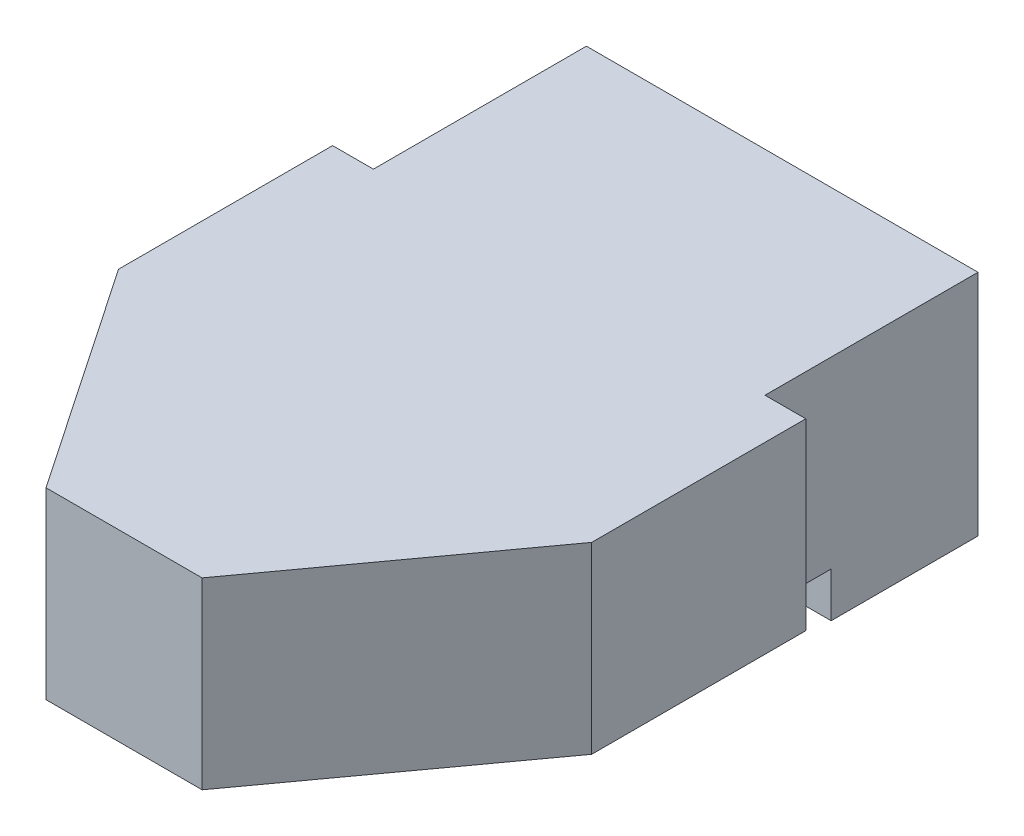
ISO-10303-21;
HEADER;
FILE_DESCRIPTION(('STEP AP214'),'2;1');
FILE_NAME('part.step','',(''),(''),'','','');
FILE_SCHEMA(('AUTOMOTIVE_DESIGN { 1 0 10303 214 1 1 1 1 }'));
ENDSEC;
DATA;
#1=APPLICATION_CONTEXT('core data for automotive mechanical design processes');
#2=APPLICATION_PROTOCOL_DEFINITION('international standard','automotive_design',2000,#1);
#3=PRODUCT_CONTEXT('',#1,'mechanical');
#4=PRODUCT('Part','Part','',(#3));
#5=PRODUCT_RELATED_PRODUCT_CATEGORY('part','',(#4));
#6=PRODUCT_DEFINITION_FORMATION('','',#4);
#7=PRODUCT_DEFINITION_CONTEXT('part definition',#1,'design');
#8=PRODUCT_DEFINITION('design','',#6,#7);
#9=PRODUCT_DEFINITION_SHAPE('','',#8);
#10=(LENGTH_UNIT() NAMED_UNIT(*) SI_UNIT(.MILLI.,.METRE.));
#11=(NAMED_UNIT(*) PLANE_ANGLE_UNIT() SI_UNIT($,.RADIAN.));
#12=(NAMED_UNIT(*) SI_UNIT($,.STERADIAN.) SOLID_ANGLE_UNIT());
#13=UNCERTAINTY_MEASURE_WITH_UNIT(LENGTH_MEASURE(1.E-05),#10,'distance_accuracy_value','');
#14=(GEOMETRIC_REPRESENTATION_CONTEXT(3) GLOBAL_UNCERTAINTY_ASSIGNED_CONTEXT((#13)) GLOBAL_UNIT_ASSIGNED_CONTEXT((#10,
#11,#12)) REPRESENTATION_CONTEXT('',''));
#15=CARTESIAN_POINT('',(0.,0.,0.));
#16=DIRECTION('',(0.,0.,1.));
#17=DIRECTION('',(1.,0.,0.));
#18=AXIS2_PLACEMENT_3D('',#15,#16,#17);
#19=CARTESIAN_POINT('',(8.6929305539632,14.,-25.99539260502));
#20=DIRECTION('',(-1.,0.,0.));
#21=DIRECTION('',(0.,0.,1.));
#22=AXIS2_PLACEMENT_3D('',#19,#20,#21);
#23=PLANE('',#22);
#24=DIRECTION('',(0.,-1.,0.));
#25=VECTOR('',#24,1.);
#26=CARTESIAN_POINT('',(8.6929305539632,2.75,-30.0506536241394));
#27=LINE('',#26,#25);
#28=CARTESIAN_POINT('',(8.6929305539632,2.75,-30.0506536241394));
#29=VERTEX_POINT('',#28);
#30=CARTESIAN_POINT('',(8.6929305539632,0.,-30.0506536241394));
#31=VERTEX_POINT('',#30);
#32=EDGE_CURVE('E49',#29,#31,#27,.T.);
#33=ORIENTED_EDGE('',*,*,#32,.F.);
#34=DIRECTION('',(0.,0.,-1.));
#35=VECTOR('',#34,1.);
#36=CARTESIAN_POINT('',(8.6929305539632,2.75,-30.0506536241394));
#37=LINE('',#36,#35);
#38=CARTESIAN_POINT('',(8.6929305539632,2.75,-25.99539260502));
#39=VERTEX_POINT('',#38);
#40=EDGE_CURVE('E378',#39,#29,#37,.T.);
#41=ORIENTED_EDGE('',*,*,#40,.F.);
#42=DIRECTION('',(0.,-1.,0.));
#43=VECTOR('',#42,1.);
#44=CARTESIAN_POINT('',(8.6929305539632,14.,-25.99539260502));
#45=LINE('',#44,#43);
#46=CARTESIAN_POINT('',(8.6929305539632,14.,-25.99539260502));
#47=VERTEX_POINT('',#46);
#48=EDGE_CURVE('E11',#47,#39,#45,.T.);
#49=ORIENTED_EDGE('',*,*,#48,.F.);
#50=DIRECTION('',(0.,0.,-1.));
#51=VECTOR('',#50,1.);
#52=CARTESIAN_POINT('',(8.6929305539632,14.,-25.99539260502));
#53=LINE('',#52,#51);
#54=CARTESIAN_POINT('',(8.6929305539632,14.,-39.0506536241394));
#55=VERTEX_POINT('',#54);
#56=EDGE_CURVE('E144',#47,#55,#53,.T.);
#57=ORIENTED_EDGE('',*,*,#56,.T.);
#58=DIRECTION('',(0.,-1.,0.));
#59=VECTOR('',#58,1.);
#60=CARTESIAN_POINT('',(8.6929305539632,14.,-39.0506536241394));
#61=LINE('',#60,#59);
#62=CARTESIAN_POINT('',(8.6929305539632,0.,-39.0506536241394));
#63=VERTEX_POINT('',#62);
#64=EDGE_CURVE('E36',#55,#63,#61,.T.);
#65=ORIENTED_EDGE('',*,*,#64,.T.);
#66=DIRECTION('',(0.,0.,-1.));
#67=VECTOR('',#66,1.);
#68=CARTESIAN_POINT('',(8.6929305539632,0.,-25.99539260502));
#69=LINE('',#68,#67);
#70=EDGE_CURVE('E136',#31,#63,#69,.T.);
#71=ORIENTED_EDGE('',*,*,#70,.F.);
#72=EDGE_LOOP('',(#33,#41,#49,#57,#65,#71));
#73=FACE_BOUND('',#72,.T.);
#74=ADVANCED_FACE('F33',(#73),#23,.T.);
#75=CARTESIAN_POINT('',(6.1929305539632,14.,-25.99539260502));
#76=DIRECTION('',(0.,0.,-1.));
#77=DIRECTION('',(-1.,0.,0.));
#78=AXIS2_PLACEMENT_3D('',#75,#76,#77);
#79=PLANE('',#78);
#80=DIRECTION('',(1.,0.,0.));
#81=VECTOR('',#80,1.);
#82=CARTESIAN_POINT('',(8.6929305539632,2.75,-25.99539260502));
#83=LINE('',#82,#81);
#84=CARTESIAN_POINT('',(6.1929305539632,2.75,-25.99539260502));
#85=VERTEX_POINT('',#84);
#86=EDGE_CURVE('E381',#85,#39,#83,.T.);
#87=ORIENTED_EDGE('',*,*,#86,.F.);
#88=DIRECTION('',(0.,-1.,0.));
#89=VECTOR('',#88,1.);
#90=CARTESIAN_POINT('',(6.1929305539632,14.,-25.99539260502));
#91=LINE('',#90,#89);
#92=CARTESIAN_POINT('',(6.1929305539632,14.,-25.99539260502));
#93=VERTEX_POINT('',#92);
#94=EDGE_CURVE('E41',#93,#85,#91,.T.);
#95=ORIENTED_EDGE('',*,*,#94,.F.);
#96=DIRECTION('',(1.,0.,0.));
#97=VECTOR('',#96,1.);
#98=CARTESIAN_POINT('',(6.1929305539632,14.,-25.99539260502));
#99=LINE('',#98,#97);
#100=EDGE_CURVE('E125',#93,#47,#99,.T.);
#101=ORIENTED_EDGE('',*,*,#100,.T.);
#102=ORIENTED_EDGE('',*,*,#48,.T.);
#103=EDGE_LOOP('',(#87,#95,#101,#102));
#104=FACE_BOUND('',#103,.T.);
#105=ADVANCED_FACE('F238',(#104),#79,.T.);
#106=CARTESIAN_POINT('',(6.1929305539632,14.,-12.8755015808554));
#107=DIRECTION('',(-1.,0.,0.));
#108=DIRECTION('',(0.,0.,1.));
#109=AXIS2_PLACEMENT_3D('',#106,#107,#108);
#110=PLANE('',#109);
#111=DIRECTION('',(0.,0.,-1.));
#112=VECTOR('',#111,1.);
#113=CARTESIAN_POINT('',(6.1929305539632,2.75,-25.99539260502));
#114=LINE('',#113,#112);
#115=CARTESIAN_POINT('',(6.1929305539632,2.75,-12.8755015808554));
#116=VERTEX_POINT('',#115);
#117=EDGE_CURVE('E112',#116,#85,#114,.T.);
#118=ORIENTED_EDGE('',*,*,#117,.F.);
#119=DIRECTION('',(0.,-1.,0.));
#120=VECTOR('',#119,1.);
#121=CARTESIAN_POINT('',(6.1929305539632,14.,-12.8755015808554));
#122=LINE('',#121,#120);
#123=CARTESIAN_POINT('',(6.1929305539632,14.,-12.8755015808554));
#124=VERTEX_POINT('',#123);
#125=EDGE_CURVE('E104',#124,#116,#122,.T.);
#126=ORIENTED_EDGE('',*,*,#125,.F.);
#127=DIRECTION('',(0.,0.,-1.));
#128=VECTOR('',#127,1.);
#129=CARTESIAN_POINT('',(6.1929305539632,14.,-12.8755015808554));
#130=LINE('',#129,#128);
#131=EDGE_CURVE('E108',#124,#93,#130,.T.);
#132=ORIENTED_EDGE('',*,*,#131,.T.);
#133=ORIENTED_EDGE('',*,*,#94,.T.);
#134=EDGE_LOOP('',(#118,#126,#132,#133));
#135=FACE_BOUND('',#134,.T.);
#136=ADVANCED_FACE('F106',(#135),#110,.T.);
#137=CARTESIAN_POINT('',(15.5712195362157,14.,0.949346375860642));
#138=DIRECTION('',(-0.827555250433313,0.,0.561384277906192));
#139=DIRECTION('',(0.561384277906192,0.,0.827555250433313));
#140=AXIS2_PLACEMENT_3D('',#137,#138,#139);
#141=PLANE('',#140);
#142=DIRECTION('',(-0.561384277906192,0.,-0.827555250433313));
#143=VECTOR('',#142,1.);
#144=CARTESIAN_POINT('',(6.1929305539632,2.75,-12.8755015808554));
#145=LINE('',#144,#143);
#146=CARTESIAN_POINT('',(15.5712195362157,2.75,0.949346375860642));
#147=VERTEX_POINT('',#146);
#148=EDGE_CURVE('E166',#147,#116,#145,.T.);
#149=ORIENTED_EDGE('',*,*,#148,.F.);
#150=DIRECTION('',(0.,-1.,0.));
#151=VECTOR('',#150,1.);
#152=CARTESIAN_POINT('',(15.5712195362157,14.,0.949346375860642));
#153=LINE('',#152,#151);
#154=CARTESIAN_POINT('',(15.5712195362157,14.,0.949346375860642));
#155=VERTEX_POINT('',#154);
#156=EDGE_CURVE('E116',#155,#147,#153,.T.);
#157=ORIENTED_EDGE('',*,*,#156,.F.);
#158=DIRECTION('',(-0.561384277906192,0.,-0.827555250433313));
#159=VECTOR('',#158,1.);
#160=CARTESIAN_POINT('',(15.5712195362157,14.,0.949346375860642));
#161=LINE('',#160,#159);
#162=EDGE_CURVE('E122',#155,#124,#161,.T.);
#163=ORIENTED_EDGE('',*,*,#162,.T.);
#164=ORIENTED_EDGE('',*,*,#125,.T.);
#165=EDGE_LOOP('',(#149,#157,#163,#164));
#166=FACE_BOUND('',#165,.T.);
#167=ADVANCED_FACE('F127',(#166),#141,.T.);
#168=CARTESIAN_POINT('',(25.1383331288491,14.,0.94934637586064));
#169=DIRECTION('',(0.,0.,1.));
#170=DIRECTION('',(1.,0.,0.));
#171=AXIS2_PLACEMENT_3D('',#168,#169,#170);
#172=PLANE('',#171);
#173=DIRECTION('',(-1.,0.,0.));
#174=VECTOR('',#173,1.);
#175=CARTESIAN_POINT('',(15.5712195362157,2.75,0.949346375860642));
#176=LINE('',#175,#174);
#177=CARTESIAN_POINT('',(25.1383331288491,2.75,0.94934637586064));
#178=VERTEX_POINT('',#177);
#179=EDGE_CURVE('E175',#178,#147,#176,.T.);
#180=ORIENTED_EDGE('',*,*,#179,.F.);
#181=DIRECTION('',(0.,-1.,0.));
#182=VECTOR('',#181,1.);
#183=CARTESIAN_POINT('',(25.1383331288491,14.,0.94934637586064));
#184=LINE('',#183,#182);
#185=CARTESIAN_POINT('',(25.1383331288491,14.,0.94934637586064));
#186=VERTEX_POINT('',#185);
#187=EDGE_CURVE('E148',#186,#178,#184,.T.);
#188=ORIENTED_EDGE('',*,*,#187,.F.);
#189=DIRECTION('',(-1.,0.,0.));
#190=VECTOR('',#189,1.);
#191=CARTESIAN_POINT('',(25.1383331288491,14.,0.94934637586064));
#192=LINE('',#191,#190);
#193=EDGE_CURVE('E129',#186,#155,#192,.T.);
#194=ORIENTED_EDGE('',*,*,#193,.T.);
#195=ORIENTED_EDGE('',*,*,#156,.T.);
#196=EDGE_LOOP('',(#180,#188,#194,#195));
#197=FACE_BOUND('',#196,.T.);
#198=ADVANCED_FACE('F228',(#197),#172,.T.);
#199=CARTESIAN_POINT('',(35.1929305539632,14.,-12.8755015808554));
#200=DIRECTION('',(0.808731561188821,0.,0.58817791690703));
#201=DIRECTION('',(0.58817791690703,0.,-0.808731561188821));
#202=AXIS2_PLACEMENT_3D('',#199,#200,#201);
#203=PLANE('',#202);
#204=DIRECTION('',(-0.58817791690703,0.,0.808731561188821));
#205=VECTOR('',#204,1.);
#206=CARTESIAN_POINT('',(25.1383331288491,2.75,0.94934637586064));
#207=LINE('',#206,#205);
#208=CARTESIAN_POINT('',(35.1929305539632,2.75,-12.8755015808554));
#209=VERTEX_POINT('',#208);
#210=EDGE_CURVE('E226',#209,#178,#207,.T.);
#211=ORIENTED_EDGE('',*,*,#210,.F.);
#212=DIRECTION('',(0.,-1.,0.));
#213=VECTOR('',#212,1.);
#214=CARTESIAN_POINT('',(35.1929305539632,14.,-12.8755015808554));
#215=LINE('',#214,#213);
#216=CARTESIAN_POINT('',(35.1929305539632,14.,-12.8755015808554));
#217=VERTEX_POINT('',#216);
#218=EDGE_CURVE('E151',#217,#209,#215,.T.);
#219=ORIENTED_EDGE('',*,*,#218,.F.);
#220=DIRECTION('',(-0.58817791690703,0.,0.808731561188821));
#221=VECTOR('',#220,1.);
#222=CARTESIAN_POINT('',(35.1929305539632,14.,-12.8755015808554));
#223=LINE('',#222,#221);
#224=EDGE_CURVE('E131',#217,#186,#223,.T.);
#225=ORIENTED_EDGE('',*,*,#224,.T.);
#226=ORIENTED_EDGE('',*,*,#187,.T.);
#227=EDGE_LOOP('',(#211,#219,#225,#226));
#228=FACE_BOUND('',#227,.T.);
#229=ADVANCED_FACE('F197',(#228),#203,.T.);
#230=CARTESIAN_POINT('',(35.1929305539632,14.,-25.99539260502));
#231=DIRECTION('',(1.,0.,0.));
#232=DIRECTION('',(0.,0.,-1.));
#233=AXIS2_PLACEMENT_3D('',#230,#231,#232);
#234=PLANE('',#233);
#235=DIRECTION('',(0.,0.,1.));
#236=VECTOR('',#235,1.);
#237=CARTESIAN_POINT('',(35.1929305539632,2.75,-12.8755015808554));
#238=LINE('',#237,#236);
#239=CARTESIAN_POINT('',(35.1929305539632,2.75,-25.99539260502));
#240=VERTEX_POINT('',#239);
#241=EDGE_CURVE('E207',#240,#209,#238,.T.);
#242=ORIENTED_EDGE('',*,*,#241,.F.);
#243=DIRECTION('',(0.,-1.,0.));
#244=VECTOR('',#243,1.);
#245=CARTESIAN_POINT('',(35.1929305539632,14.,-25.99539260502));
#246=LINE('',#245,#244);
#247=CARTESIAN_POINT('',(35.1929305539632,14.,-25.99539260502));
#248=VERTEX_POINT('',#247);
#249=EDGE_CURVE('E154',#248,#240,#246,.T.);
#250=ORIENTED_EDGE('',*,*,#249,.F.);
#251=DIRECTION('',(0.,0.,1.));
#252=VECTOR('',#251,1.);
#253=CARTESIAN_POINT('',(35.1929305539632,14.,-25.99539260502));
#254=LINE('',#253,#252);
#255=EDGE_CURVE('E191',#248,#217,#254,.T.);
#256=ORIENTED_EDGE('',*,*,#255,.T.);
#257=ORIENTED_EDGE('',*,*,#218,.T.);
#258=EDGE_LOOP('',(#242,#250,#256,#257));
#259=FACE_BOUND('',#258,.T.);
#260=ADVANCED_FACE('F203',(#259),#234,.T.);
#261=CARTESIAN_POINT('',(32.6929305539632,14.,-25.99539260502));
#262=DIRECTION('',(0.,0.,-1.));
#263=DIRECTION('',(-1.,0.,0.));
#264=AXIS2_PLACEMENT_3D('',#261,#262,#263);
#265=PLANE('',#264);
#266=DIRECTION('',(1.,0.,0.));
#267=VECTOR('',#266,1.);
#268=CARTESIAN_POINT('',(35.1929305539632,2.75,-25.99539260502));
#269=LINE('',#268,#267);
#270=CARTESIAN_POINT('',(32.6929305539632,2.75,-25.99539260502));
#271=VERTEX_POINT('',#270);
#272=EDGE_CURVE('E213',#271,#240,#269,.T.);
#273=ORIENTED_EDGE('',*,*,#272,.F.);
#274=DIRECTION('',(0.,-1.,0.));
#275=VECTOR('',#274,1.);
#276=CARTESIAN_POINT('',(32.6929305539632,14.,-25.99539260502));
#277=LINE('',#276,#275);
#278=CARTESIAN_POINT('',(32.6929305539632,14.,-25.99539260502));
#279=VERTEX_POINT('',#278);
#280=EDGE_CURVE('E157',#279,#271,#277,.T.);
#281=ORIENTED_EDGE('',*,*,#280,.F.);
#282=DIRECTION('',(1.,0.,0.));
#283=VECTOR('',#282,1.);
#284=CARTESIAN_POINT('',(32.6929305539632,14.,-25.99539260502));
#285=LINE('',#284,#283);
#286=EDGE_CURVE('E188',#279,#248,#285,.T.);
#287=ORIENTED_EDGE('',*,*,#286,.T.);
#288=ORIENTED_EDGE('',*,*,#249,.T.);
#289=EDGE_LOOP('',(#273,#281,#287,#288));
#290=FACE_BOUND('',#289,.T.);
#291=ADVANCED_FACE('F210',(#290),#265,.T.);
#292=CARTESIAN_POINT('',(32.6929305539632,14.,-39.0506536241394));
#293=DIRECTION('',(1.,0.,0.));
#294=DIRECTION('',(0.,0.,-1.));
#295=AXIS2_PLACEMENT_3D('',#292,#293,#294);
#296=PLANE('',#295);
#297=DIRECTION('',(0.,-1.,0.));
#298=VECTOR('',#297,1.);
#299=CARTESIAN_POINT('',(32.6929305539632,2.75,-30.0506536241394));
#300=LINE('',#299,#298);
#301=CARTESIAN_POINT('',(32.6929305539632,2.75,-30.0506536241394));
#302=VERTEX_POINT('',#301);
#303=CARTESIAN_POINT('',(32.6929305539632,0.,-30.0506536241394));
#304=VERTEX_POINT('',#303);
#305=EDGE_CURVE('E177',#302,#304,#300,.T.);
#306=ORIENTED_EDGE('',*,*,#305,.T.);
#307=DIRECTION('',(0.,0.,1.));
#308=VECTOR('',#307,1.);
#309=CARTESIAN_POINT('',(32.6929305539632,0.,-39.0506536241394));
#310=LINE('',#309,#308);
#311=CARTESIAN_POINT('',(32.6929305539632,0.,-39.0506536241394));
#312=VERTEX_POINT('',#311);
#313=EDGE_CURVE('E142',#312,#304,#310,.T.);
#314=ORIENTED_EDGE('',*,*,#313,.F.);
#315=DIRECTION('',(0.,-1.,0.));
#316=VECTOR('',#315,1.);
#317=CARTESIAN_POINT('',(32.6929305539632,14.,-39.0506536241394));
#318=LINE('',#317,#316);
#319=CARTESIAN_POINT('',(32.6929305539632,14.,-39.0506536241394));
#320=VERTEX_POINT('',#319);
#321=EDGE_CURVE('E73',#320,#312,#318,.T.);
#322=ORIENTED_EDGE('',*,*,#321,.F.);
#323=DIRECTION('',(0.,0.,1.));
#324=VECTOR('',#323,1.);
#325=CARTESIAN_POINT('',(32.6929305539632,14.,-39.0506536241394));
#326=LINE('',#325,#324);
#327=EDGE_CURVE('E185',#320,#279,#326,.T.);
#328=ORIENTED_EDGE('',*,*,#327,.T.);
#329=ORIENTED_EDGE('',*,*,#280,.T.);
#330=DIRECTION('',(0.,0.,1.));
#331=VECTOR('',#330,1.);
#332=CARTESIAN_POINT('',(32.6929305539632,2.75,-25.99539260502));
#333=LINE('',#332,#331);
#334=EDGE_CURVE('E372',#302,#271,#333,.T.);
#335=ORIENTED_EDGE('',*,*,#334,.F.);
#336=EDGE_LOOP('',(#306,#314,#322,#328,#329,#335));
#337=FACE_BOUND('',#336,.T.);
#338=ADVANCED_FACE('F305',(#337),#296,.T.);
#339=CARTESIAN_POINT('',(8.6929305539632,14.,-39.0506536241394));
#340=DIRECTION('',(0.,0.,-1.));
#341=DIRECTION('',(-1.,0.,0.));
#342=AXIS2_PLACEMENT_3D('',#339,#340,#341);
#343=PLANE('',#342);
#344=DIRECTION('',(1.,0.,0.));
#345=VECTOR('',#344,1.);
#346=CARTESIAN_POINT('',(8.6929305539632,0.,-39.0506536241394));
#347=LINE('',#346,#345);
#348=EDGE_CURVE('E138',#63,#312,#347,.T.);
#349=ORIENTED_EDGE('',*,*,#348,.F.);
#350=ORIENTED_EDGE('',*,*,#64,.F.);
#351=DIRECTION('',(1.,0.,0.));
#352=VECTOR('',#351,1.);
#353=CARTESIAN_POINT('',(8.6929305539632,14.,-39.0506536241394));
#354=LINE('',#353,#352);
#355=EDGE_CURVE('E183',#55,#320,#354,.T.);
#356=ORIENTED_EDGE('',*,*,#355,.T.);
#357=ORIENTED_EDGE('',*,*,#321,.T.);
#358=EDGE_LOOP('',(#349,#350,#356,#357));
#359=FACE_BOUND('',#358,.T.);
#360=ADVANCED_FACE('F160',(#359),#343,.T.);
#361=CARTESIAN_POINT('',(0.,14.,0.));
#362=DIRECTION('',(0.,-1.,0.));
#363=DIRECTION('',(0.,0.,-1.));
#364=AXIS2_PLACEMENT_3D('',#361,#362,#363);
#365=PLANE('',#364);
#366=ORIENTED_EDGE('',*,*,#56,.F.);
#367=ORIENTED_EDGE('',*,*,#100,.F.);
#368=ORIENTED_EDGE('',*,*,#131,.F.);
#369=ORIENTED_EDGE('',*,*,#162,.F.);
#370=ORIENTED_EDGE('',*,*,#193,.F.);
#371=ORIENTED_EDGE('',*,*,#224,.F.);
#372=ORIENTED_EDGE('',*,*,#255,.F.);
#373=ORIENTED_EDGE('',*,*,#286,.F.);
#374=ORIENTED_EDGE('',*,*,#327,.F.);
#375=ORIENTED_EDGE('',*,*,#355,.F.);
#376=EDGE_LOOP('',(#366,#367,#368,#369,#370,#371,#372,#373,#374,#375));
#377=FACE_BOUND('',#376,.T.);
#378=ADVANCED_FACE('F120',(#377),#365,.F.);
#379=CARTESIAN_POINT('',(0.,0.,0.));
#380=DIRECTION('',(0.,-1.,0.));
#381=DIRECTION('',(0.,0.,-1.));
#382=AXIS2_PLACEMENT_3D('',#379,#380,#381);
#383=PLANE('',#382);
#384=DIRECTION('',(1.,0.,0.));
#385=VECTOR('',#384,1.);
#386=CARTESIAN_POINT('',(8.6929305539632,0.,-30.0506536241394));
#387=LINE('',#386,#385);
#388=EDGE_CURVE('E163',#31,#304,#387,.T.);
#389=ORIENTED_EDGE('',*,*,#388,.F.);
#390=ORIENTED_EDGE('',*,*,#70,.T.);
#391=ORIENTED_EDGE('',*,*,#348,.T.);
#392=ORIENTED_EDGE('',*,*,#313,.T.);
#393=EDGE_LOOP('',(#389,#390,#391,#392));
#394=FACE_BOUND('',#393,.T.);
#395=ADVANCED_FACE('F162',(#394),#383,.T.);
#396=CARTESIAN_POINT('',(8.6929305539632,2.75,-30.0506536241394));
#397=DIRECTION('',(0.,0.,-1.));
#398=DIRECTION('',(-1.,0.,0.));
#399=AXIS2_PLACEMENT_3D('',#396,#397,#398);
#400=PLANE('',#399);
#401=ORIENTED_EDGE('',*,*,#388,.T.);
#402=ORIENTED_EDGE('',*,*,#305,.F.);
#403=DIRECTION('',(1.,0.,0.));
#404=VECTOR('',#403,1.);
#405=CARTESIAN_POINT('',(8.6929305539632,2.75,-30.0506536241394));
#406=LINE('',#405,#404);
#407=EDGE_CURVE('E375',#29,#302,#406,.T.);
#408=ORIENTED_EDGE('',*,*,#407,.F.);
#409=ORIENTED_EDGE('',*,*,#32,.T.);
#410=EDGE_LOOP('',(#401,#402,#408,#409));
#411=FACE_BOUND('',#410,.T.);
#412=ADVANCED_FACE('F252',(#411),#400,.F.);
#413=CARTESIAN_POINT('',(0.,2.75,0.));
#414=DIRECTION('',(0.,1.,0.));
#415=DIRECTION('',(0.,0.,1.));
#416=AXIS2_PLACEMENT_3D('',#413,#414,#415);
#417=PLANE('',#416);
#418=CARTESIAN_POINT('',(20.5,2.75,-18.));
#419=DIRECTION('',(0.,-1.,0.));
#420=DIRECTION('',(0.,0.,-1.));
#421=AXIS2_PLACEMENT_3D('',#418,#419,#420);
#422=CIRCLE('',#421,2.25);
#423=CARTESIAN_POINT('',(20.5,2.75,-20.25));
#424=VERTEX_POINT('',#423);
#425=EDGE_CURVE('E167',#424,#424,#422,.T.);
#426=ORIENTED_EDGE('',*,*,#425,.F.);
#427=EDGE_LOOP('',(#426));
#428=FACE_BOUND('',#427,.T.);
#429=ORIENTED_EDGE('',*,*,#148,.T.);
#430=ORIENTED_EDGE('',*,*,#117,.T.);
#431=ORIENTED_EDGE('',*,*,#86,.T.);
#432=ORIENTED_EDGE('',*,*,#40,.T.);
#433=ORIENTED_EDGE('',*,*,#407,.T.);
#434=ORIENTED_EDGE('',*,*,#334,.T.);
#435=ORIENTED_EDGE('',*,*,#272,.T.);
#436=ORIENTED_EDGE('',*,*,#241,.T.);
#437=ORIENTED_EDGE('',*,*,#210,.T.);
#438=ORIENTED_EDGE('',*,*,#179,.T.);
#439=EDGE_LOOP('',(#429,#430,#431,#432,#433,#434,#435,#436,#437,#438));
#440=FACE_BOUND('',#439,.T.);
#441=ADVANCED_FACE('F225',(#428,#440),#417,.F.);
#442=CARTESIAN_POINT('',(20.5,-2.75,-18.));
#443=DIRECTION('',(0.,-1.,0.));
#444=DIRECTION('',(0.,0.,-1.));
#445=AXIS2_PLACEMENT_3D('',#442,#443,#444);
#446=PLANE('',#445);
#447=CARTESIAN_POINT('',(20.5,-2.75,-18.));
#448=DIRECTION('',(0.,-1.,0.));
#449=DIRECTION('',(0.,0.,-1.));
#450=AXIS2_PLACEMENT_3D('',#447,#448,#449);
#451=CIRCLE('',#450,2.25);
#452=CARTESIAN_POINT('',(20.5,-2.75,-20.25));
#453=VERTEX_POINT('',#452);
#454=EDGE_CURVE('E139',#453,#453,#451,.T.);
#455=ORIENTED_EDGE('',*,*,#454,.T.);
#456=EDGE_LOOP('',(#455));
#457=FACE_BOUND('',#456,.T.);
#458=ADVANCED_FACE('F258',(#457),#446,.T.);
#459=CARTESIAN_POINT('',(20.5,-2.75,-18.));
#460=DIRECTION('',(0.,1.,0.));
#461=DIRECTION('',(0.,0.,1.));
#462=AXIS2_PLACEMENT_3D('',#459,#460,#461);
#463=CYLINDRICAL_SURFACE('',#462,2.25);
#464=ORIENTED_EDGE('',*,*,#454,.F.);
#465=EDGE_LOOP('',(#464));
#466=FACE_BOUND('',#465,.T.);
#467=ORIENTED_EDGE('',*,*,#425,.T.);
#468=EDGE_LOOP('',(#467));
#469=FACE_BOUND('',#468,.T.);
#470=ADVANCED_FACE('F255',(#466,#469),#463,.T.);
#471=CLOSED_SHELL('',(#74,#105,#136,#167,#198,#229,#260,#291,#338,#360,#378,#395,#412,#441,#458,#470));
#472=MANIFOLD_SOLID_BREP('B2',#471);
#473=ADVANCED_BREP_SHAPE_REPRESENTATION('',(#18,#472),#14);
#474=SHAPE_DEFINITION_REPRESENTATION(#9,#473);
ENDSEC;
END-ISO-10303-21;
